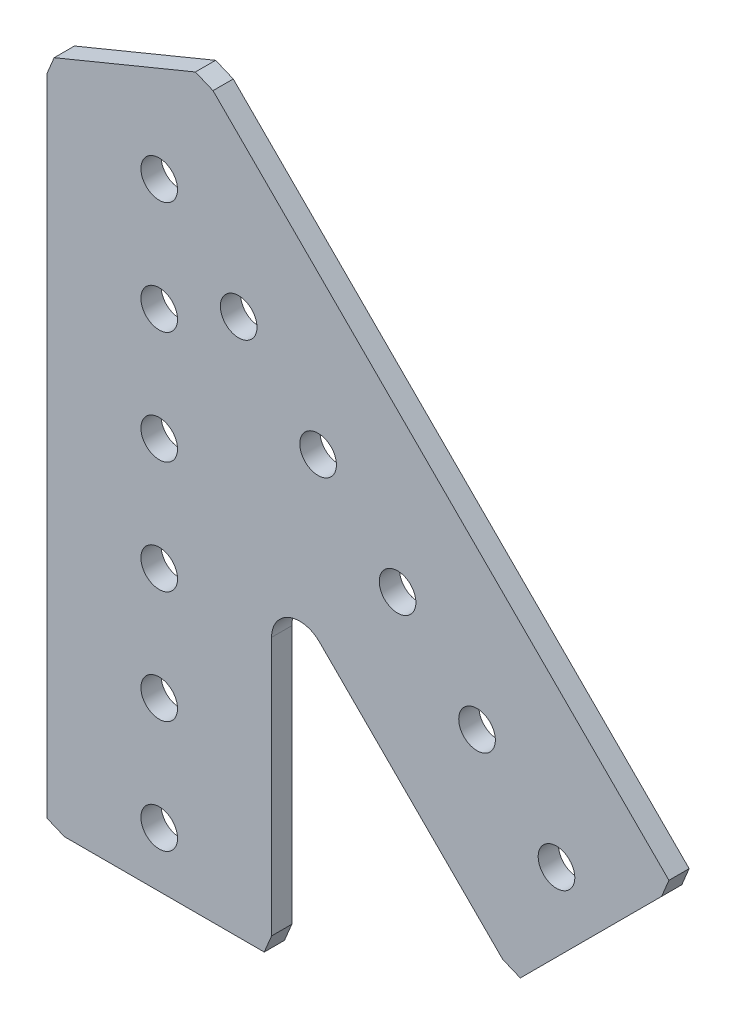
ISO-10303-21;
HEADER;
FILE_DESCRIPTION(('STEP AP214'),'2;1');
FILE_NAME('part.step','',(''),(''),'','','');
FILE_SCHEMA(('AUTOMOTIVE_DESIGN { 1 0 10303 214 1 1 1 1 }'));
ENDSEC;
DATA;
#1=APPLICATION_CONTEXT('core data for automotive mechanical design processes');
#2=APPLICATION_PROTOCOL_DEFINITION('international standard','automotive_design',2000,#1);
#3=PRODUCT_CONTEXT('',#1,'mechanical');
#4=PRODUCT('Part','Part','',(#3));
#5=PRODUCT_RELATED_PRODUCT_CATEGORY('part','',(#4));
#6=PRODUCT_DEFINITION_FORMATION('','',#4);
#7=PRODUCT_DEFINITION_CONTEXT('part definition',#1,'design');
#8=PRODUCT_DEFINITION('design','',#6,#7);
#9=PRODUCT_DEFINITION_SHAPE('','',#8);
#10=(LENGTH_UNIT() NAMED_UNIT(*) SI_UNIT(.MILLI.,.METRE.));
#11=(NAMED_UNIT(*) PLANE_ANGLE_UNIT() SI_UNIT($,.RADIAN.));
#12=(NAMED_UNIT(*) SI_UNIT($,.STERADIAN.) SOLID_ANGLE_UNIT());
#13=UNCERTAINTY_MEASURE_WITH_UNIT(LENGTH_MEASURE(1.E-05),#10,'distance_accuracy_value','');
#14=(GEOMETRIC_REPRESENTATION_CONTEXT(3) GLOBAL_UNCERTAINTY_ASSIGNED_CONTEXT((#13)) GLOBAL_UNIT_ASSIGNED_CONTEXT((#10,
#11,#12)) REPRESENTATION_CONTEXT('',''));
#15=CARTESIAN_POINT('',(0.,0.,0.));
#16=DIRECTION('',(0.,0.,1.));
#17=DIRECTION('',(1.,0.,0.));
#18=AXIS2_PLACEMENT_3D('',#15,#16,#17);
#19=CARTESIAN_POINT('',(58.1920596645279,-40.4111525448115,2.286));
#20=DIRECTION('',(0.,0.,1.));
#21=DIRECTION('',(1.,0.,0.));
#22=AXIS2_PLACEMENT_3D('',#19,#20,#21);
#23=PLANE('',#22);
#24=DIRECTION('',(0.,1.,0.));
#25=VECTOR('',#24,1.);
#26=CARTESIAN_POINT('',(-12.7,-69.723,2.286));
#27=LINE('',#26,#25);
#28=CARTESIAN_POINT('',(-12.7,3.95642841278006,2.286));
#29=VERTEX_POINT('',#28);
#30=CARTESIAN_POINT('',(-12.7,-68.893532284943,2.286));
#31=VERTEX_POINT('',#30);
#32=EDGE_CURVE('E204',#29,#31,#27,.F.);
#33=ORIENTED_EDGE('',*,*,#32,.T.);
#34=DIRECTION('',(-0.923253761571208,0.384190697108371,0.));
#35=VECTOR('',#34,1.);
#36=CARTESIAN_POINT('',(-26.3114668927381,-63.2294351841751,2.286));
#37=LINE('',#36,#35);
#38=CARTESIAN_POINT('',(-10.7066951287677,-69.723,2.286));
#39=VERTEX_POINT('',#38);
#40=EDGE_CURVE('E185',#31,#39,#37,.F.);
#41=ORIENTED_EDGE('',*,*,#40,.T.);
#42=DIRECTION('',(1.,0.,0.));
#43=VECTOR('',#42,1.);
#44=CARTESIAN_POINT('',(12.7,-69.723,2.286));
#45=LINE('',#44,#43);
#46=CARTESIAN_POINT('',(11.870532284943,-69.723,2.286));
#47=VERTEX_POINT('',#46);
#48=EDGE_CURVE('E172',#39,#47,#45,.T.);
#49=ORIENTED_EDGE('',*,*,#48,.T.);
#50=DIRECTION('',(0.384190697108371,0.923253761571208,0.));
#51=VECTOR('',#50,1.);
#52=CARTESIAN_POINT('',(34.8495441547326,-14.5018316956871,2.286));
#53=LINE('',#52,#51);
#54=CARTESIAN_POINT('',(12.7,-67.7296951287677,2.286));
#55=VERTEX_POINT('',#54);
#56=EDGE_CURVE('E170',#55,#47,#53,.F.);
#57=ORIENTED_EDGE('',*,*,#56,.F.);
#58=DIRECTION('',(0.,1.,0.));
#59=VECTOR('',#58,1.);
#60=CARTESIAN_POINT('',(12.7,0.,2.286));
#61=LINE('',#60,#59);
#62=CARTESIAN_POINT('',(12.7,-38.5052454250948,2.286));
#63=VERTEX_POINT('',#62);
#64=EDGE_CURVE('E114',#55,#63,#61,.T.);
#65=ORIENTED_EDGE('',*,*,#64,.T.);
#66=CARTESIAN_POINT('',(15.875,-38.5052454250948,2.286));
#67=DIRECTION('',(0.,0.,1.));
#68=DIRECTION('',(1.,0.,0.));
#69=AXIS2_PLACEMENT_3D('',#66,#67,#68);
#70=CIRCLE('',#69,3.175);
#71=CARTESIAN_POINT('',(18.1200640302673,-36.2601813948275,2.286));
#72=VERTEX_POINT('',#71);
#73=EDGE_CURVE('E128',#63,#72,#70,.F.);
#74=ORIENTED_EDGE('',*,*,#73,.T.);
#75=DIRECTION('',(0.707106781186548,-0.707106781186547,0.));
#76=VECTOR('',#75,1.);
#77=CARTESIAN_POINT('',(-9.07005868228013,-9.07005868228013,2.286));
#78=LINE('',#77,#76);
#79=CARTESIAN_POINT('',(38.8201611292449,-56.9602784938051,2.286));
#80=VERTEX_POINT('',#79);
#81=EDGE_CURVE('E120',#80,#72,#78,.F.);
#82=ORIENTED_EDGE('',*,*,#81,.F.);
#83=DIRECTION('',(0.923253761571208,-0.384190697108369,0.));
#84=VECTOR('',#83,1.);
#85=CARTESIAN_POINT('',(-14.4741719075916,-34.7830745509771,2.286));
#86=LINE('',#85,#84);
#87=CARTESIAN_POINT('',(40.8134660004771,-57.7897462088621,2.286));
#88=VERTEX_POINT('',#87);
#89=EDGE_CURVE('E139',#88,#80,#86,.F.);
#90=ORIENTED_EDGE('',*,*,#89,.F.);
#91=DIRECTION('',(-0.707106781186552,-0.707106781186544,0.));
#92=VECTOR('',#91,1.);
#93=CARTESIAN_POINT('',(58.1920596645279,-40.4111525448115,2.286));
#94=LINE('',#93,#92);
#95=CARTESIAN_POINT('',(56.780673371383,-41.8225388379564,2.286));
#96=VERTEX_POINT('',#95);
#97=EDGE_CURVE('E154',#88,#96,#94,.F.);
#98=ORIENTED_EDGE('',*,*,#97,.T.);
#99=DIRECTION('',(0.384190697108367,0.923253761571209,0.));
#100=VECTOR('',#99,1.);
#101=CARTESIAN_POINT('',(63.2343893106752,-26.3135284378871,2.286));
#102=LINE('',#101,#100);
#103=CARTESIAN_POINT('',(57.6101410864401,-39.8292339667238,2.286));
#104=VERTEX_POINT('',#103);
#105=EDGE_CURVE('E273',#104,#96,#102,.F.);
#106=ORIENTED_EDGE('',*,*,#105,.F.);
#107=DIRECTION('',(0.707106781186543,-0.707106781186552,0.));
#108=VECTOR('',#107,1.);
#109=CARTESIAN_POINT('',(4.91177915452289,12.8691279651941,2.286));
#110=LINE('',#109,#108);
#111=CARTESIAN_POINT('',(6.0810134917472,11.6998936279698,2.286));
#112=VERTEX_POINT('',#111);
#113=EDGE_CURVE('E263',#104,#112,#110,.F.);
#114=ORIENTED_EDGE('',*,*,#113,.T.);
#115=DIRECTION('',(0.923253761571208,-0.384190697108371,0.));
#116=VECTOR('',#115,1.);
#117=CARTESIAN_POINT('',(5.0475894362815,12.1299291445348,2.286));
#118=LINE('',#117,#116);
#119=CARTESIAN_POINT('',(4.0877086205139,12.5293613430272,2.286));
#120=VERTEX_POINT('',#119);
#121=EDGE_CURVE('E246',#112,#120,#118,.F.);
#122=ORIENTED_EDGE('',*,*,#121,.T.);
#123=DIRECTION('',(0.924502842757107,0.381175148368868,0.));
#124=VECTOR('',#123,1.);
#125=CARTESIAN_POINT('',(-12.7,5.60774138876715,2.286));
#126=LINE('',#125,#124);
#127=CARTESIAN_POINT('',(-11.870532284943,5.94973328401229,2.286));
#128=VERTEX_POINT('',#127);
#129=EDGE_CURVE('E232',#120,#128,#126,.F.);
#130=ORIENTED_EDGE('',*,*,#129,.T.);
#131=DIRECTION('',(0.38419069710837,0.923253761571208,0.));
#132=VECTOR('',#131,1.);
#133=CARTESIAN_POINT('',(-12.2288152980036,5.08873862171331,2.286));
#134=LINE('',#133,#132);
#135=EDGE_CURVE('E218',#128,#29,#134,.F.);
#136=ORIENTED_EDGE('',*,*,#135,.T.);
#137=EDGE_LOOP('',(#33,#41,#49,#57,#65,#74,#82,#90,#98,#106,#114,#122,#130,#136));
#138=FACE_BOUND('',#137,.T.);
#139=CARTESIAN_POINT('',(0.,-63.5,2.286));
#140=DIRECTION('',(0.,0.,-1.));
#141=DIRECTION('',(-1.,0.,0.));
#142=AXIS2_PLACEMENT_3D('',#139,#140,#141);
#143=CIRCLE('',#142,2.0701);
#144=CARTESIAN_POINT('',(-2.07009999999999,-63.5,2.286));
#145=VERTEX_POINT('',#144);
#146=EDGE_CURVE('E167',#145,#145,#143,.T.);
#147=ORIENTED_EDGE('',*,*,#146,.T.);
#148=EDGE_LOOP('',(#147));
#149=FACE_BOUND('',#148,.T.);
#150=CARTESIAN_POINT('',(35.9210244842764,-35.9210244842768,2.286));
#151=DIRECTION('',(0.,0.,-1.));
#152=DIRECTION('',(-1.,0.,0.));
#153=AXIS2_PLACEMENT_3D('',#150,#151,#152);
#154=CIRCLE('',#153,2.0701);
#155=CARTESIAN_POINT('',(33.8509244842764,-35.9210244842768,2.286));
#156=VERTEX_POINT('',#155);
#157=EDGE_CURVE('E333',#156,#156,#154,.T.);
#158=ORIENTED_EDGE('',*,*,#157,.T.);
#159=EDGE_LOOP('',(#158));
#160=FACE_BOUND('',#159,.T.);
#161=CARTESIAN_POINT('',(17.9605122421382,-17.9605122421384,2.286));
#162=DIRECTION('',(0.,0.,-1.));
#163=DIRECTION('',(-1.,0.,0.));
#164=AXIS2_PLACEMENT_3D('',#161,#162,#163);
#165=CIRCLE('',#164,2.0701);
#166=CARTESIAN_POINT('',(15.8904122421382,-17.9605122421384,2.286));
#167=VERTEX_POINT('',#166);
#168=EDGE_CURVE('E336',#167,#167,#165,.T.);
#169=ORIENTED_EDGE('',*,*,#168,.T.);
#170=EDGE_LOOP('',(#169));
#171=FACE_BOUND('',#170,.T.);
#172=CARTESIAN_POINT('',(3.9907631702977E-13,-38.1,2.286));
#173=DIRECTION('',(0.,0.,-1.));
#174=DIRECTION('',(-1.,0.,0.));
#175=AXIS2_PLACEMENT_3D('',#172,#173,#174);
#176=CIRCLE('',#175,2.0701);
#177=CARTESIAN_POINT('',(-2.0700999999996,-38.1,2.286));
#178=VERTEX_POINT('',#177);
#179=EDGE_CURVE('E339',#178,#178,#176,.T.);
#180=ORIENTED_EDGE('',*,*,#179,.T.);
#181=EDGE_LOOP('',(#180));
#182=FACE_BOUND('',#181,.T.);
#183=CARTESIAN_POINT('',(1.33025439009923E-13,-12.7,2.286));
#184=DIRECTION('',(0.,0.,-1.));
#185=DIRECTION('',(-1.,0.,0.));
#186=AXIS2_PLACEMENT_3D('',#183,#184,#185);
#187=CIRCLE('',#186,2.0701);
#188=CARTESIAN_POINT('',(-2.07009999999987,-12.7,2.286));
#189=VERTEX_POINT('',#188);
#190=EDGE_CURVE('E342',#189,#189,#187,.T.);
#191=ORIENTED_EDGE('',*,*,#190,.T.);
#192=EDGE_LOOP('',(#191));
#193=FACE_BOUND('',#192,.T.);
#194=CARTESIAN_POINT('',(0.,0.,2.286));
#195=DIRECTION('',(0.,0.,-1.));
#196=DIRECTION('',(-1.,0.,0.));
#197=AXIS2_PLACEMENT_3D('',#194,#195,#196);
#198=CIRCLE('',#197,2.0701);
#199=CARTESIAN_POINT('',(-2.0701,0.,2.286));
#200=VERTEX_POINT('',#199);
#201=EDGE_CURVE('E345',#200,#200,#198,.T.);
#202=ORIENTED_EDGE('',*,*,#201,.T.);
#203=EDGE_LOOP('',(#202));
#204=FACE_BOUND('',#203,.T.);
#205=CARTESIAN_POINT('',(8.98025612106911,-8.9802561210692,2.286));
#206=DIRECTION('',(0.,0.,-1.));
#207=DIRECTION('',(-1.,0.,0.));
#208=AXIS2_PLACEMENT_3D('',#205,#206,#207);
#209=CIRCLE('',#208,2.0701);
#210=CARTESIAN_POINT('',(6.9101561210691,-8.9802561210692,2.286));
#211=VERTEX_POINT('',#210);
#212=EDGE_CURVE('E348',#211,#211,#209,.T.);
#213=ORIENTED_EDGE('',*,*,#212,.T.);
#214=EDGE_LOOP('',(#213));
#215=FACE_BOUND('',#214,.T.);
#216=CARTESIAN_POINT('',(2.66050878019847E-13,-25.4,2.286));
#217=DIRECTION('',(0.,0.,-1.));
#218=DIRECTION('',(-1.,0.,0.));
#219=AXIS2_PLACEMENT_3D('',#216,#217,#218);
#220=CIRCLE('',#219,2.0701);
#221=CARTESIAN_POINT('',(-2.07009999999973,-25.4,2.286));
#222=VERTEX_POINT('',#221);
#223=EDGE_CURVE('E351',#222,#222,#220,.T.);
#224=ORIENTED_EDGE('',*,*,#223,.T.);
#225=EDGE_LOOP('',(#224));
#226=FACE_BOUND('',#225,.T.);
#227=CARTESIAN_POINT('',(0.,-50.8,2.286));
#228=DIRECTION('',(0.,0.,-1.));
#229=DIRECTION('',(-1.,0.,0.));
#230=AXIS2_PLACEMENT_3D('',#227,#228,#229);
#231=CIRCLE('',#230,2.0701);
#232=CARTESIAN_POINT('',(-2.07009999999999,-50.8,2.286));
#233=VERTEX_POINT('',#232);
#234=EDGE_CURVE('E354',#233,#233,#231,.T.);
#235=ORIENTED_EDGE('',*,*,#234,.T.);
#236=EDGE_LOOP('',(#235));
#237=FACE_BOUND('',#236,.T.);
#238=CARTESIAN_POINT('',(26.9407683632073,-26.9407683632076,2.286));
#239=DIRECTION('',(0.,0.,-1.));
#240=DIRECTION('',(-1.,0.,0.));
#241=AXIS2_PLACEMENT_3D('',#238,#239,#240);
#242=CIRCLE('',#241,2.0701);
#243=CARTESIAN_POINT('',(24.8706683632073,-26.9407683632076,2.286));
#244=VERTEX_POINT('',#243);
#245=EDGE_CURVE('E356',#244,#244,#242,.T.);
#246=ORIENTED_EDGE('',*,*,#245,.T.);
#247=EDGE_LOOP('',(#246));
#248=FACE_BOUND('',#247,.T.);
#249=CARTESIAN_POINT('',(44.9012806053455,-44.901280605346,2.286));
#250=DIRECTION('',(0.,0.,-1.));
#251=DIRECTION('',(-1.,0.,0.));
#252=AXIS2_PLACEMENT_3D('',#249,#250,#251);
#253=CIRCLE('',#252,2.0701);
#254=CARTESIAN_POINT('',(42.8311806053455,-44.901280605346,2.286));
#255=VERTEX_POINT('',#254);
#256=EDGE_CURVE('E20',#255,#255,#253,.T.);
#257=ORIENTED_EDGE('',*,*,#256,.T.);
#258=EDGE_LOOP('',(#257));
#259=FACE_BOUND('',#258,.T.);
#260=ADVANCED_FACE('F17',(#138,#149,#160,#171,#182,#193,#204,#215,#226,#237,#248,#259),#23,.T.);
#261=CARTESIAN_POINT('',(44.9012806053455,-44.901280605346,2.286));
#262=DIRECTION('',(0.,0.,-1.));
#263=DIRECTION('',(-1.,0.,0.));
#264=AXIS2_PLACEMENT_3D('',#261,#262,#263);
#265=CYLINDRICAL_SURFACE('',#264,2.0701);
#266=CARTESIAN_POINT('',(44.9012806053455,-44.901280605346,0.));
#267=DIRECTION('',(0.,0.,-1.));
#268=DIRECTION('',(-1.,0.,0.));
#269=AXIS2_PLACEMENT_3D('',#266,#267,#268);
#270=CIRCLE('',#269,2.0701);
#271=CARTESIAN_POINT('',(42.8311806053455,-44.901280605346,0.));
#272=VERTEX_POINT('',#271);
#273=EDGE_CURVE('E161',#272,#272,#270,.T.);
#274=ORIENTED_EDGE('',*,*,#273,.T.);
#275=EDGE_LOOP('',(#274));
#276=FACE_BOUND('',#275,.T.);
#277=ORIENTED_EDGE('',*,*,#256,.F.);
#278=EDGE_LOOP('',(#277));
#279=FACE_BOUND('',#278,.T.);
#280=ADVANCED_FACE('F364',(#276,#279),#265,.F.);
#281=CARTESIAN_POINT('',(26.9407683632073,-26.9407683632076,2.286));
#282=DIRECTION('',(0.,0.,-1.));
#283=DIRECTION('',(-1.,0.,0.));
#284=AXIS2_PLACEMENT_3D('',#281,#282,#283);
#285=CYLINDRICAL_SURFACE('',#284,2.0701);
#286=CARTESIAN_POINT('',(26.9407683632073,-26.9407683632076,0.));
#287=DIRECTION('',(0.,0.,-1.));
#288=DIRECTION('',(-1.,0.,0.));
#289=AXIS2_PLACEMENT_3D('',#286,#287,#288);
#290=CIRCLE('',#289,2.0701);
#291=CARTESIAN_POINT('',(24.8706683632073,-26.9407683632076,0.));
#292=VERTEX_POINT('',#291);
#293=EDGE_CURVE('E326',#292,#292,#290,.T.);
#294=ORIENTED_EDGE('',*,*,#293,.T.);
#295=EDGE_LOOP('',(#294));
#296=FACE_BOUND('',#295,.T.);
#297=ORIENTED_EDGE('',*,*,#245,.F.);
#298=EDGE_LOOP('',(#297));
#299=FACE_BOUND('',#298,.T.);
#300=ADVANCED_FACE('F366',(#296,#299),#285,.F.);
#301=CARTESIAN_POINT('',(0.,-50.8,2.286));
#302=DIRECTION('',(0.,0.,-1.));
#303=DIRECTION('',(-1.,0.,0.));
#304=AXIS2_PLACEMENT_3D('',#301,#302,#303);
#305=CYLINDRICAL_SURFACE('',#304,2.0701);
#306=CARTESIAN_POINT('',(0.,-50.8,0.));
#307=DIRECTION('',(0.,0.,-1.));
#308=DIRECTION('',(-1.,0.,0.));
#309=AXIS2_PLACEMENT_3D('',#306,#307,#308);
#310=CIRCLE('',#309,2.0701);
#311=CARTESIAN_POINT('',(-2.07009999999999,-50.8,0.));
#312=VERTEX_POINT('',#311);
#313=EDGE_CURVE('E323',#312,#312,#310,.T.);
#314=ORIENTED_EDGE('',*,*,#313,.T.);
#315=EDGE_LOOP('',(#314));
#316=FACE_BOUND('',#315,.T.);
#317=ORIENTED_EDGE('',*,*,#234,.F.);
#318=EDGE_LOOP('',(#317));
#319=FACE_BOUND('',#318,.T.);
#320=ADVANCED_FACE('F373',(#316,#319),#305,.F.);
#321=CARTESIAN_POINT('',(2.66050878019847E-13,-25.4,2.286));
#322=DIRECTION('',(0.,0.,-1.));
#323=DIRECTION('',(-1.,0.,0.));
#324=AXIS2_PLACEMENT_3D('',#321,#322,#323);
#325=CYLINDRICAL_SURFACE('',#324,2.0701);
#326=CARTESIAN_POINT('',(2.66050878019847E-13,-25.4,0.));
#327=DIRECTION('',(0.,0.,-1.));
#328=DIRECTION('',(-1.,0.,0.));
#329=AXIS2_PLACEMENT_3D('',#326,#327,#328);
#330=CIRCLE('',#329,2.0701);
#331=CARTESIAN_POINT('',(-2.07009999999973,-25.4,0.));
#332=VERTEX_POINT('',#331);
#333=EDGE_CURVE('E320',#332,#332,#330,.T.);
#334=ORIENTED_EDGE('',*,*,#333,.T.);
#335=EDGE_LOOP('',(#334));
#336=FACE_BOUND('',#335,.T.);
#337=ORIENTED_EDGE('',*,*,#223,.F.);
#338=EDGE_LOOP('',(#337));
#339=FACE_BOUND('',#338,.T.);
#340=ADVANCED_FACE('F463',(#336,#339),#325,.F.);
#341=CARTESIAN_POINT('',(8.98025612106911,-8.9802561210692,2.286));
#342=DIRECTION('',(0.,0.,-1.));
#343=DIRECTION('',(-1.,0.,0.));
#344=AXIS2_PLACEMENT_3D('',#341,#342,#343);
#345=CYLINDRICAL_SURFACE('',#344,2.0701);
#346=CARTESIAN_POINT('',(8.98025612106911,-8.9802561210692,0.));
#347=DIRECTION('',(0.,0.,-1.));
#348=DIRECTION('',(-1.,0.,0.));
#349=AXIS2_PLACEMENT_3D('',#346,#347,#348);
#350=CIRCLE('',#349,2.0701);
#351=CARTESIAN_POINT('',(6.9101561210691,-8.9802561210692,0.));
#352=VERTEX_POINT('',#351);
#353=EDGE_CURVE('E317',#352,#352,#350,.T.);
#354=ORIENTED_EDGE('',*,*,#353,.T.);
#355=EDGE_LOOP('',(#354));
#356=FACE_BOUND('',#355,.T.);
#357=ORIENTED_EDGE('',*,*,#212,.F.);
#358=EDGE_LOOP('',(#357));
#359=FACE_BOUND('',#358,.T.);
#360=ADVANCED_FACE('F459',(#356,#359),#345,.F.);
#361=CARTESIAN_POINT('',(0.,0.,2.286));
#362=DIRECTION('',(0.,0.,-1.));
#363=DIRECTION('',(-1.,0.,0.));
#364=AXIS2_PLACEMENT_3D('',#361,#362,#363);
#365=CYLINDRICAL_SURFACE('',#364,2.0701);
#366=CARTESIAN_POINT('',(0.,0.,0.));
#367=DIRECTION('',(0.,0.,-1.));
#368=DIRECTION('',(-1.,0.,0.));
#369=AXIS2_PLACEMENT_3D('',#366,#367,#368);
#370=CIRCLE('',#369,2.0701);
#371=CARTESIAN_POINT('',(-2.0701,0.,0.));
#372=VERTEX_POINT('',#371);
#373=EDGE_CURVE('E314',#372,#372,#370,.T.);
#374=ORIENTED_EDGE('',*,*,#373,.T.);
#375=EDGE_LOOP('',(#374));
#376=FACE_BOUND('',#375,.T.);
#377=ORIENTED_EDGE('',*,*,#201,.F.);
#378=EDGE_LOOP('',(#377));
#379=FACE_BOUND('',#378,.T.);
#380=ADVANCED_FACE('F455',(#376,#379),#365,.F.);
#381=CARTESIAN_POINT('',(1.33025439009923E-13,-12.7,2.286));
#382=DIRECTION('',(0.,0.,-1.));
#383=DIRECTION('',(-1.,0.,0.));
#384=AXIS2_PLACEMENT_3D('',#381,#382,#383);
#385=CYLINDRICAL_SURFACE('',#384,2.0701);
#386=CARTESIAN_POINT('',(1.33025439009923E-13,-12.7,0.));
#387=DIRECTION('',(0.,0.,-1.));
#388=DIRECTION('',(-1.,0.,0.));
#389=AXIS2_PLACEMENT_3D('',#386,#387,#388);
#390=CIRCLE('',#389,2.0701);
#391=CARTESIAN_POINT('',(-2.07009999999987,-12.7,0.));
#392=VERTEX_POINT('',#391);
#393=EDGE_CURVE('E311',#392,#392,#390,.T.);
#394=ORIENTED_EDGE('',*,*,#393,.T.);
#395=EDGE_LOOP('',(#394));
#396=FACE_BOUND('',#395,.T.);
#397=ORIENTED_EDGE('',*,*,#190,.F.);
#398=EDGE_LOOP('',(#397));
#399=FACE_BOUND('',#398,.T.);
#400=ADVANCED_FACE('F451',(#396,#399),#385,.F.);
#401=CARTESIAN_POINT('',(3.9907631702977E-13,-38.1,2.286));
#402=DIRECTION('',(0.,0.,-1.));
#403=DIRECTION('',(-1.,0.,0.));
#404=AXIS2_PLACEMENT_3D('',#401,#402,#403);
#405=CYLINDRICAL_SURFACE('',#404,2.0701);
#406=CARTESIAN_POINT('',(3.9907631702977E-13,-38.1,0.));
#407=DIRECTION('',(0.,0.,-1.));
#408=DIRECTION('',(-1.,0.,0.));
#409=AXIS2_PLACEMENT_3D('',#406,#407,#408);
#410=CIRCLE('',#409,2.0701);
#411=CARTESIAN_POINT('',(-2.0700999999996,-38.1,0.));
#412=VERTEX_POINT('',#411);
#413=EDGE_CURVE('E308',#412,#412,#410,.T.);
#414=ORIENTED_EDGE('',*,*,#413,.T.);
#415=EDGE_LOOP('',(#414));
#416=FACE_BOUND('',#415,.T.);
#417=ORIENTED_EDGE('',*,*,#179,.F.);
#418=EDGE_LOOP('',(#417));
#419=FACE_BOUND('',#418,.T.);
#420=ADVANCED_FACE('F447',(#416,#419),#405,.F.);
#421=CARTESIAN_POINT('',(17.9605122421382,-17.9605122421384,2.286));
#422=DIRECTION('',(0.,0.,-1.));
#423=DIRECTION('',(-1.,0.,0.));
#424=AXIS2_PLACEMENT_3D('',#421,#422,#423);
#425=CYLINDRICAL_SURFACE('',#424,2.0701);
#426=CARTESIAN_POINT('',(17.9605122421382,-17.9605122421384,0.));
#427=DIRECTION('',(0.,0.,-1.));
#428=DIRECTION('',(-1.,0.,0.));
#429=AXIS2_PLACEMENT_3D('',#426,#427,#428);
#430=CIRCLE('',#429,2.0701);
#431=CARTESIAN_POINT('',(15.8904122421382,-17.9605122421384,0.));
#432=VERTEX_POINT('',#431);
#433=EDGE_CURVE('E305',#432,#432,#430,.T.);
#434=ORIENTED_EDGE('',*,*,#433,.T.);
#435=EDGE_LOOP('',(#434));
#436=FACE_BOUND('',#435,.T.);
#437=ORIENTED_EDGE('',*,*,#168,.F.);
#438=EDGE_LOOP('',(#437));
#439=FACE_BOUND('',#438,.T.);
#440=ADVANCED_FACE('F443',(#436,#439),#425,.F.);
#441=CARTESIAN_POINT('',(35.9210244842764,-35.9210244842768,2.286));
#442=DIRECTION('',(0.,0.,-1.));
#443=DIRECTION('',(-1.,0.,0.));
#444=AXIS2_PLACEMENT_3D('',#441,#442,#443);
#445=CYLINDRICAL_SURFACE('',#444,2.0701);
#446=CARTESIAN_POINT('',(35.9210244842764,-35.9210244842768,0.));
#447=DIRECTION('',(0.,0.,-1.));
#448=DIRECTION('',(-1.,0.,0.));
#449=AXIS2_PLACEMENT_3D('',#446,#447,#448);
#450=CIRCLE('',#449,2.0701);
#451=CARTESIAN_POINT('',(33.8509244842764,-35.9210244842768,0.));
#452=VERTEX_POINT('',#451);
#453=EDGE_CURVE('E302',#452,#452,#450,.T.);
#454=ORIENTED_EDGE('',*,*,#453,.T.);
#455=EDGE_LOOP('',(#454));
#456=FACE_BOUND('',#455,.T.);
#457=ORIENTED_EDGE('',*,*,#157,.F.);
#458=EDGE_LOOP('',(#457));
#459=FACE_BOUND('',#458,.T.);
#460=ADVANCED_FACE('F439',(#456,#459),#445,.F.);
#461=CARTESIAN_POINT('',(0.,-63.5,2.286));
#462=DIRECTION('',(0.,0.,-1.));
#463=DIRECTION('',(-1.,0.,0.));
#464=AXIS2_PLACEMENT_3D('',#461,#462,#463);
#465=CYLINDRICAL_SURFACE('',#464,2.0701);
#466=CARTESIAN_POINT('',(0.,-63.5,0.));
#467=DIRECTION('',(0.,0.,-1.));
#468=DIRECTION('',(-1.,0.,0.));
#469=AXIS2_PLACEMENT_3D('',#466,#467,#468);
#470=CIRCLE('',#469,2.0701);
#471=CARTESIAN_POINT('',(-2.07009999999999,-63.5,0.));
#472=VERTEX_POINT('',#471);
#473=EDGE_CURVE('E299',#472,#472,#470,.T.);
#474=ORIENTED_EDGE('',*,*,#473,.T.);
#475=EDGE_LOOP('',(#474));
#476=FACE_BOUND('',#475,.T.);
#477=ORIENTED_EDGE('',*,*,#146,.F.);
#478=EDGE_LOOP('',(#477));
#479=FACE_BOUND('',#478,.T.);
#480=ADVANCED_FACE('F435',(#476,#479),#465,.F.);
#481=CARTESIAN_POINT('',(12.7,0.,0.));
#482=DIRECTION('',(-1.,0.,0.));
#483=DIRECTION('',(0.,0.,1.));
#484=AXIS2_PLACEMENT_3D('',#481,#482,#483);
#485=PLANE('',#484);
#486=DIRECTION('',(0.,1.,0.));
#487=VECTOR('',#486,1.);
#488=CARTESIAN_POINT('',(12.7,-40.4111525448115,0.));
#489=LINE('',#488,#487);
#490=CARTESIAN_POINT('',(12.7,-67.7296951287677,0.));
#491=VERTEX_POINT('',#490);
#492=CARTESIAN_POINT('',(12.7,-38.5052454250948,0.));
#493=VERTEX_POINT('',#492);
#494=EDGE_CURVE('E298',#491,#493,#489,.T.);
#495=ORIENTED_EDGE('',*,*,#494,.T.);
#496=DIRECTION('',(0.,0.,1.));
#497=VECTOR('',#496,1.);
#498=CARTESIAN_POINT('',(12.7,-38.5052454250948,0.));
#499=LINE('',#498,#497);
#500=EDGE_CURVE('E133',#493,#63,#499,.T.);
#501=ORIENTED_EDGE('',*,*,#500,.T.);
#502=ORIENTED_EDGE('',*,*,#64,.F.);
#503=DIRECTION('',(0.,0.,1.));
#504=VECTOR('',#503,1.);
#505=CARTESIAN_POINT('',(12.7,-67.7296951287677,0.));
#506=LINE('',#505,#504);
#507=EDGE_CURVE('E158',#491,#55,#506,.T.);
#508=ORIENTED_EDGE('',*,*,#507,.F.);
#509=EDGE_LOOP('',(#495,#501,#502,#508));
#510=FACE_BOUND('',#509,.T.);
#511=ADVANCED_FACE('F432',(#510),#485,.F.);
#512=CARTESIAN_POINT('',(15.875,-38.5052454250948,0.));
#513=DIRECTION('',(0.,0.,1.));
#514=DIRECTION('',(1.,0.,0.));
#515=AXIS2_PLACEMENT_3D('',#512,#513,#514);
#516=CYLINDRICAL_SURFACE('',#515,3.175);
#517=ORIENTED_EDGE('',*,*,#500,.F.);
#518=CARTESIAN_POINT('',(15.875,-38.5052454250948,0.));
#519=DIRECTION('',(0.,0.,1.));
#520=DIRECTION('',(1.,0.,0.));
#521=AXIS2_PLACEMENT_3D('',#518,#519,#520);
#522=CIRCLE('',#521,3.175);
#523=CARTESIAN_POINT('',(18.1200640302673,-36.2601813948275,0.));
#524=VERTEX_POINT('',#523);
#525=EDGE_CURVE('E138',#493,#524,#522,.F.);
#526=ORIENTED_EDGE('',*,*,#525,.T.);
#527=DIRECTION('',(0.,0.,1.));
#528=VECTOR('',#527,1.);
#529=CARTESIAN_POINT('',(18.1200640302673,-36.2601813948275,0.));
#530=LINE('',#529,#528);
#531=EDGE_CURVE('E124',#72,#524,#530,.F.);
#532=ORIENTED_EDGE('',*,*,#531,.F.);
#533=ORIENTED_EDGE('',*,*,#73,.F.);
#534=EDGE_LOOP('',(#517,#526,#532,#533));
#535=FACE_BOUND('',#534,.T.);
#536=ADVANCED_FACE('F136',(#535),#516,.F.);
#537=CARTESIAN_POINT('',(-9.07005868228013,-9.07005868228013,0.));
#538=DIRECTION('',(-0.707106781186547,-0.707106781186548,0.));
#539=DIRECTION('',(0.707106781186548,-0.707106781186547,0.));
#540=AXIS2_PLACEMENT_3D('',#537,#538,#539);
#541=PLANE('',#540);
#542=ORIENTED_EDGE('',*,*,#81,.T.);
#543=ORIENTED_EDGE('',*,*,#531,.T.);
#544=DIRECTION('',(0.707106781186547,-0.707106781186548,0.));
#545=VECTOR('',#544,1.);
#546=CARTESIAN_POINT('',(18.1200640302673,-36.2601813948275,0.));
#547=LINE('',#546,#545);
#548=CARTESIAN_POINT('',(38.8201611292448,-56.9602784938051,0.));
#549=VERTEX_POINT('',#548);
#550=EDGE_CURVE('E150',#524,#549,#547,.T.);
#551=ORIENTED_EDGE('',*,*,#550,.T.);
#552=DIRECTION('',(0.,0.,1.));
#553=VECTOR('',#552,1.);
#554=CARTESIAN_POINT('',(38.8201611292449,-56.9602784938051,0.));
#555=LINE('',#554,#553);
#556=EDGE_CURVE('E126',#80,#549,#555,.F.);
#557=ORIENTED_EDGE('',*,*,#556,.F.);
#558=EDGE_LOOP('',(#542,#543,#551,#557));
#559=FACE_BOUND('',#558,.T.);
#560=ADVANCED_FACE('F121',(#559),#541,.T.);
#561=CARTESIAN_POINT('',(-14.4741719075916,-34.7830745509771,0.));
#562=DIRECTION('',(-0.384190697108369,-0.923253761571208,0.));
#563=DIRECTION('',(0.923253761571208,-0.384190697108369,0.));
#564=AXIS2_PLACEMENT_3D('',#561,#562,#563);
#565=PLANE('',#564);
#566=DIRECTION('',(0.923253761571207,-0.384190697108372,0.));
#567=VECTOR('',#566,1.);
#568=CARTESIAN_POINT('',(38.8201611292449,-56.9602784938051,0.));
#569=LINE('',#568,#567);
#570=CARTESIAN_POINT('',(40.8134660004771,-57.7897462088621,0.));
#571=VERTEX_POINT('',#570);
#572=EDGE_CURVE('E146',#549,#571,#569,.T.);
#573=ORIENTED_EDGE('',*,*,#572,.T.);
#574=DIRECTION('',(0.,0.,1.));
#575=VECTOR('',#574,1.);
#576=CARTESIAN_POINT('',(40.8134660004771,-57.7897462088621,2.286));
#577=LINE('',#576,#575);
#578=EDGE_CURVE('E275',#571,#88,#577,.T.);
#579=ORIENTED_EDGE('',*,*,#578,.T.);
#580=ORIENTED_EDGE('',*,*,#89,.T.);
#581=ORIENTED_EDGE('',*,*,#556,.T.);
#582=EDGE_LOOP('',(#573,#579,#580,#581));
#583=FACE_BOUND('',#582,.T.);
#584=ADVANCED_FACE('F423',(#583),#565,.T.);
#585=CARTESIAN_POINT('',(58.1920596645279,-40.4111525448115,2.286));
#586=DIRECTION('',(-0.707106781186544,0.707106781186552,0.));
#587=DIRECTION('',(-0.707106781186552,-0.707106781186544,0.));
#588=AXIS2_PLACEMENT_3D('',#585,#586,#587);
#589=PLANE('',#588);
#590=DIRECTION('',(0.707106781186552,0.707106781186544,0.));
#591=VECTOR('',#590,1.);
#592=CARTESIAN_POINT('',(40.8134660004771,-57.7897462088621,0.));
#593=LINE('',#592,#591);
#594=CARTESIAN_POINT('',(56.780673371383,-41.8225388379564,0.));
#595=VERTEX_POINT('',#594);
#596=EDGE_CURVE('E149',#571,#595,#593,.T.);
#597=ORIENTED_EDGE('',*,*,#596,.T.);
#598=DIRECTION('',(0.,0.,1.));
#599=VECTOR('',#598,1.);
#600=CARTESIAN_POINT('',(56.780673371383,-41.8225388379564,0.));
#601=LINE('',#600,#599);
#602=EDGE_CURVE('E265',#96,#595,#601,.F.);
#603=ORIENTED_EDGE('',*,*,#602,.F.);
#604=ORIENTED_EDGE('',*,*,#97,.F.);
#605=ORIENTED_EDGE('',*,*,#578,.F.);
#606=EDGE_LOOP('',(#597,#603,#604,#605));
#607=FACE_BOUND('',#606,.T.);
#608=ADVANCED_FACE('F419',(#607),#589,.F.);
#609=CARTESIAN_POINT('',(63.2343893106752,-26.3135284378871,0.));
#610=DIRECTION('',(0.923253761571209,-0.384190697108367,0.));
#611=DIRECTION('',(0.384190697108367,0.923253761571209,0.));
#612=AXIS2_PLACEMENT_3D('',#609,#610,#611);
#613=PLANE('',#612);
#614=DIRECTION('',(0.384190697108359,0.923253761571212,0.));
#615=VECTOR('',#614,1.);
#616=CARTESIAN_POINT('',(56.780673371383,-41.8225388379564,0.));
#617=LINE('',#616,#615);
#618=CARTESIAN_POINT('',(57.6101410864401,-39.8292339667238,0.));
#619=VERTEX_POINT('',#618);
#620=EDGE_CURVE('E270',#595,#619,#617,.T.);
#621=ORIENTED_EDGE('',*,*,#620,.T.);
#622=DIRECTION('',(0.,0.,1.));
#623=VECTOR('',#622,1.);
#624=CARTESIAN_POINT('',(57.6101410864401,-39.8292339667238,2.286));
#625=LINE('',#624,#623);
#626=EDGE_CURVE('E260',#619,#104,#625,.T.);
#627=ORIENTED_EDGE('',*,*,#626,.T.);
#628=ORIENTED_EDGE('',*,*,#105,.T.);
#629=ORIENTED_EDGE('',*,*,#602,.T.);
#630=EDGE_LOOP('',(#621,#627,#628,#629));
#631=FACE_BOUND('',#630,.T.);
#632=ADVANCED_FACE('F415',(#631),#613,.T.);
#633=CARTESIAN_POINT('',(4.91177915452289,12.8691279651941,2.286));
#634=DIRECTION('',(-0.707106781186552,-0.707106781186543,0.));
#635=DIRECTION('',(0.707106781186543,-0.707106781186552,0.));
#636=AXIS2_PLACEMENT_3D('',#633,#634,#635);
#637=PLANE('',#636);
#638=DIRECTION('',(-0.707106781186544,0.707106781186552,0.));
#639=VECTOR('',#638,1.);
#640=CARTESIAN_POINT('',(57.6101410864401,-39.8292339667238,0.));
#641=LINE('',#640,#639);
#642=CARTESIAN_POINT('',(6.0810134917472,11.6998936279698,0.));
#643=VERTEX_POINT('',#642);
#644=EDGE_CURVE('E255',#619,#643,#641,.T.);
#645=ORIENTED_EDGE('',*,*,#644,.T.);
#646=DIRECTION('',(0.,0.,1.));
#647=VECTOR('',#646,1.);
#648=CARTESIAN_POINT('',(6.0810134917472,11.6998936279698,0.));
#649=LINE('',#648,#647);
#650=EDGE_CURVE('E250',#643,#112,#649,.T.);
#651=ORIENTED_EDGE('',*,*,#650,.T.);
#652=ORIENTED_EDGE('',*,*,#113,.F.);
#653=ORIENTED_EDGE('',*,*,#626,.F.);
#654=EDGE_LOOP('',(#645,#651,#652,#653));
#655=FACE_BOUND('',#654,.T.);
#656=ADVANCED_FACE('F411',(#655),#637,.F.);
#657=CARTESIAN_POINT('',(5.0475894362815,12.1299291445348,0.));
#658=DIRECTION('',(-0.384190697108371,-0.923253761571208,0.));
#659=DIRECTION('',(0.923253761571208,-0.384190697108371,0.));
#660=AXIS2_PLACEMENT_3D('',#657,#658,#659);
#661=PLANE('',#660);
#662=ORIENTED_EDGE('',*,*,#650,.F.);
#663=DIRECTION('',(-0.923253761571208,0.38419069710837,0.));
#664=VECTOR('',#663,1.);
#665=CARTESIAN_POINT('',(6.0810134917472,11.6998936279698,0.));
#666=LINE('',#665,#664);
#667=CARTESIAN_POINT('',(4.0877086205139,12.5293613430272,0.));
#668=VERTEX_POINT('',#667);
#669=EDGE_CURVE('E241',#643,#668,#666,.T.);
#670=ORIENTED_EDGE('',*,*,#669,.T.);
#671=DIRECTION('',(0.,0.,1.));
#672=VECTOR('',#671,1.);
#673=CARTESIAN_POINT('',(4.0877086205139,12.5293613430272,2.286));
#674=LINE('',#673,#672);
#675=EDGE_CURVE('E236',#668,#120,#674,.T.);
#676=ORIENTED_EDGE('',*,*,#675,.T.);
#677=ORIENTED_EDGE('',*,*,#121,.F.);
#678=EDGE_LOOP('',(#662,#670,#676,#677));
#679=FACE_BOUND('',#678,.T.);
#680=ADVANCED_FACE('F407',(#679),#661,.F.);
#681=CARTESIAN_POINT('',(-12.7,5.60774138876715,2.286));
#682=DIRECTION('',(0.381175148368868,-0.924502842757107,0.));
#683=DIRECTION('',(0.924502842757107,0.381175148368868,0.));
#684=AXIS2_PLACEMENT_3D('',#681,#682,#683);
#685=PLANE('',#684);
#686=DIRECTION('',(0.,0.,1.));
#687=VECTOR('',#686,1.);
#688=CARTESIAN_POINT('',(-11.870532284943,5.94973328401229,0.));
#689=LINE('',#688,#687);
#690=CARTESIAN_POINT('',(-11.870532284943,5.94973328401229,0.));
#691=VERTEX_POINT('',#690);
#692=EDGE_CURVE('E222',#691,#128,#689,.T.);
#693=ORIENTED_EDGE('',*,*,#692,.T.);
#694=ORIENTED_EDGE('',*,*,#129,.F.);
#695=ORIENTED_EDGE('',*,*,#675,.F.);
#696=DIRECTION('',(-0.924502842757107,-0.381175148368868,0.));
#697=VECTOR('',#696,1.);
#698=CARTESIAN_POINT('',(4.08770862051389,12.5293613430272,0.));
#699=LINE('',#698,#697);
#700=EDGE_CURVE('E227',#668,#691,#699,.T.);
#701=ORIENTED_EDGE('',*,*,#700,.T.);
#702=EDGE_LOOP('',(#693,#694,#695,#701));
#703=FACE_BOUND('',#702,.T.);
#704=ADVANCED_FACE('F403',(#703),#685,.F.);
#705=CARTESIAN_POINT('',(-12.2288152980036,5.08873862171331,0.));
#706=DIRECTION('',(0.923253761571208,-0.38419069710837,0.));
#707=DIRECTION('',(0.38419069710837,0.923253761571208,0.));
#708=AXIS2_PLACEMENT_3D('',#705,#706,#707);
#709=PLANE('',#708);
#710=ORIENTED_EDGE('',*,*,#692,.F.);
#711=DIRECTION('',(-0.384190697108371,-0.923253761571207,0.));
#712=VECTOR('',#711,1.);
#713=CARTESIAN_POINT('',(-11.870532284943,5.94973328401229,0.));
#714=LINE('',#713,#712);
#715=CARTESIAN_POINT('',(-12.7,3.95642841278006,0.));
#716=VERTEX_POINT('',#715);
#717=EDGE_CURVE('E213',#691,#716,#714,.T.);
#718=ORIENTED_EDGE('',*,*,#717,.T.);
#719=DIRECTION('',(0.,0.,1.));
#720=VECTOR('',#719,1.);
#721=CARTESIAN_POINT('',(-12.7,3.95642841278006,2.286));
#722=LINE('',#721,#720);
#723=EDGE_CURVE('E208',#716,#29,#722,.T.);
#724=ORIENTED_EDGE('',*,*,#723,.T.);
#725=ORIENTED_EDGE('',*,*,#135,.F.);
#726=EDGE_LOOP('',(#710,#718,#724,#725));
#727=FACE_BOUND('',#726,.T.);
#728=ADVANCED_FACE('F399',(#727),#709,.F.);
#729=CARTESIAN_POINT('',(-12.7,-69.723,2.286));
#730=DIRECTION('',(1.,0.,0.));
#731=DIRECTION('',(0.,1.,0.));
#732=AXIS2_PLACEMENT_3D('',#729,#730,#731);
#733=PLANE('',#732);
#734=DIRECTION('',(0.,0.,1.));
#735=VECTOR('',#734,1.);
#736=CARTESIAN_POINT('',(-12.7,-68.893532284943,0.));
#737=LINE('',#736,#735);
#738=CARTESIAN_POINT('',(-12.7,-68.893532284943,0.));
#739=VERTEX_POINT('',#738);
#740=EDGE_CURVE('E189',#739,#31,#737,.T.);
#741=ORIENTED_EDGE('',*,*,#740,.T.);
#742=ORIENTED_EDGE('',*,*,#32,.F.);
#743=ORIENTED_EDGE('',*,*,#723,.F.);
#744=DIRECTION('',(0.,1.,0.));
#745=VECTOR('',#744,1.);
#746=CARTESIAN_POINT('',(-12.7,-40.4111525448115,0.));
#747=LINE('',#746,#745);
#748=EDGE_CURVE('E199',#716,#739,#747,.F.);
#749=ORIENTED_EDGE('',*,*,#748,.T.);
#750=EDGE_LOOP('',(#741,#742,#743,#749));
#751=FACE_BOUND('',#750,.T.);
#752=ADVANCED_FACE('F395',(#751),#733,.F.);
#753=CARTESIAN_POINT('',(-26.3114668927381,-63.2294351841751,0.));
#754=DIRECTION('',(0.384190697108371,0.923253761571208,0.));
#755=DIRECTION('',(-0.923253761571208,0.384190697108371,0.));
#756=AXIS2_PLACEMENT_3D('',#753,#754,#755);
#757=PLANE('',#756);
#758=ORIENTED_EDGE('',*,*,#740,.F.);
#759=DIRECTION('',(0.92325376157121,-0.384190697108366,0.));
#760=VECTOR('',#759,1.);
#761=CARTESIAN_POINT('',(-12.7,-68.893532284943,0.));
#762=LINE('',#761,#760);
#763=CARTESIAN_POINT('',(-10.7066951287677,-69.723,0.));
#764=VERTEX_POINT('',#763);
#765=EDGE_CURVE('E194',#739,#764,#762,.T.);
#766=ORIENTED_EDGE('',*,*,#765,.T.);
#767=DIRECTION('',(0.,0.,1.));
#768=VECTOR('',#767,1.);
#769=CARTESIAN_POINT('',(-10.7066951287677,-69.723,2.286));
#770=LINE('',#769,#768);
#771=EDGE_CURVE('E177',#764,#39,#770,.T.);
#772=ORIENTED_EDGE('',*,*,#771,.T.);
#773=ORIENTED_EDGE('',*,*,#40,.F.);
#774=EDGE_LOOP('',(#758,#766,#772,#773));
#775=FACE_BOUND('',#774,.T.);
#776=ADVANCED_FACE('F391',(#775),#757,.F.);
#777=CARTESIAN_POINT('',(12.7,-69.723,2.286));
#778=DIRECTION('',(0.,1.,0.));
#779=DIRECTION('',(0.,0.,1.));
#780=AXIS2_PLACEMENT_3D('',#777,#778,#779);
#781=PLANE('',#780);
#782=ORIENTED_EDGE('',*,*,#48,.F.);
#783=ORIENTED_EDGE('',*,*,#771,.F.);
#784=DIRECTION('',(1.,0.,0.));
#785=VECTOR('',#784,1.);
#786=CARTESIAN_POINT('',(58.1920596645279,-69.723,0.));
#787=LINE('',#786,#785);
#788=CARTESIAN_POINT('',(11.870532284943,-69.723,0.));
#789=VERTEX_POINT('',#788);
#790=EDGE_CURVE('E26',#764,#789,#787,.T.);
#791=ORIENTED_EDGE('',*,*,#790,.T.);
#792=DIRECTION('',(0.,0.,1.));
#793=VECTOR('',#792,1.);
#794=CARTESIAN_POINT('',(11.870532284943,-69.723,0.));
#795=LINE('',#794,#793);
#796=EDGE_CURVE('E34',#47,#789,#795,.F.);
#797=ORIENTED_EDGE('',*,*,#796,.F.);
#798=EDGE_LOOP('',(#782,#783,#791,#797));
#799=FACE_BOUND('',#798,.T.);
#800=ADVANCED_FACE('F384',(#799),#781,.F.);
#801=CARTESIAN_POINT('',(34.8495441547326,-14.5018316956871,0.));
#802=DIRECTION('',(0.923253761571208,-0.384190697108371,0.));
#803=DIRECTION('',(0.384190697108371,0.923253761571208,0.));
#804=AXIS2_PLACEMENT_3D('',#801,#802,#803);
#805=PLANE('',#804);
#806=DIRECTION('',(0.384190697108369,0.923253761571208,0.));
#807=VECTOR('',#806,1.);
#808=CARTESIAN_POINT('',(11.870532284943,-69.723,0.));
#809=LINE('',#808,#807);
#810=EDGE_CURVE('E10',#789,#491,#809,.T.);
#811=ORIENTED_EDGE('',*,*,#810,.T.);
#812=ORIENTED_EDGE('',*,*,#507,.T.);
#813=ORIENTED_EDGE('',*,*,#56,.T.);
#814=ORIENTED_EDGE('',*,*,#796,.T.);
#815=EDGE_LOOP('',(#811,#812,#813,#814));
#816=FACE_BOUND('',#815,.T.);
#817=ADVANCED_FACE('F378',(#816),#805,.T.);
#818=CARTESIAN_POINT('',(58.1920596645279,-40.4111525448115,0.));
#819=DIRECTION('',(0.,0.,1.));
#820=DIRECTION('',(1.,0.,0.));
#821=AXIS2_PLACEMENT_3D('',#818,#819,#820);
#822=PLANE('',#821);
#823=ORIENTED_EDGE('',*,*,#790,.F.);
#824=ORIENTED_EDGE('',*,*,#765,.F.);
#825=ORIENTED_EDGE('',*,*,#748,.F.);
#826=ORIENTED_EDGE('',*,*,#717,.F.);
#827=ORIENTED_EDGE('',*,*,#700,.F.);
#828=ORIENTED_EDGE('',*,*,#669,.F.);
#829=ORIENTED_EDGE('',*,*,#644,.F.);
#830=ORIENTED_EDGE('',*,*,#620,.F.);
#831=ORIENTED_EDGE('',*,*,#596,.F.);
#832=ORIENTED_EDGE('',*,*,#572,.F.);
#833=ORIENTED_EDGE('',*,*,#550,.F.);
#834=ORIENTED_EDGE('',*,*,#525,.F.);
#835=ORIENTED_EDGE('',*,*,#494,.F.);
#836=ORIENTED_EDGE('',*,*,#810,.F.);
#837=EDGE_LOOP('',(#823,#824,#825,#826,#827,#828,#829,#830,#831,#832,#833,#834,#835,#836));
#838=FACE_BOUND('',#837,.T.);
#839=ORIENTED_EDGE('',*,*,#473,.F.);
#840=EDGE_LOOP('',(#839));
#841=FACE_BOUND('',#840,.T.);
#842=ORIENTED_EDGE('',*,*,#453,.F.);
#843=EDGE_LOOP('',(#842));
#844=FACE_BOUND('',#843,.T.);
#845=ORIENTED_EDGE('',*,*,#433,.F.);
#846=EDGE_LOOP('',(#845));
#847=FACE_BOUND('',#846,.T.);
#848=ORIENTED_EDGE('',*,*,#413,.F.);
#849=EDGE_LOOP('',(#848));
#850=FACE_BOUND('',#849,.T.);
#851=ORIENTED_EDGE('',*,*,#393,.F.);
#852=EDGE_LOOP('',(#851));
#853=FACE_BOUND('',#852,.T.);
#854=ORIENTED_EDGE('',*,*,#373,.F.);
#855=EDGE_LOOP('',(#854));
#856=FACE_BOUND('',#855,.T.);
#857=ORIENTED_EDGE('',*,*,#353,.F.);
#858=EDGE_LOOP('',(#857));
#859=FACE_BOUND('',#858,.T.);
#860=ORIENTED_EDGE('',*,*,#333,.F.);
#861=EDGE_LOOP('',(#860));
#862=FACE_BOUND('',#861,.T.);
#863=ORIENTED_EDGE('',*,*,#313,.F.);
#864=EDGE_LOOP('',(#863));
#865=FACE_BOUND('',#864,.T.);
#866=ORIENTED_EDGE('',*,*,#293,.F.);
#867=EDGE_LOOP('',(#866));
#868=FACE_BOUND('',#867,.T.);
#869=ORIENTED_EDGE('',*,*,#273,.F.);
#870=EDGE_LOOP('',(#869));
#871=FACE_BOUND('',#870,.T.);
#872=ADVANCED_FACE('F376',(#838,#841,#844,#847,#850,#853,#856,#859,#862,#865,#868,#871),#822,.F.);
#873=CLOSED_SHELL('',(#260,#280,#300,#320,#340,#360,#380,#400,#420,#440,#460,#480,#511,#536,
#560,#584,#608,#632,#656,#680,#704,#728,#752,#776,#800,#817,#872));
#874=MANIFOLD_SOLID_BREP('B1',#873);
#875=ADVANCED_BREP_SHAPE_REPRESENTATION('',(#18,#874),#14);
#876=SHAPE_DEFINITION_REPRESENTATION(#9,#875);
ENDSEC;
END-ISO-10303-21;
